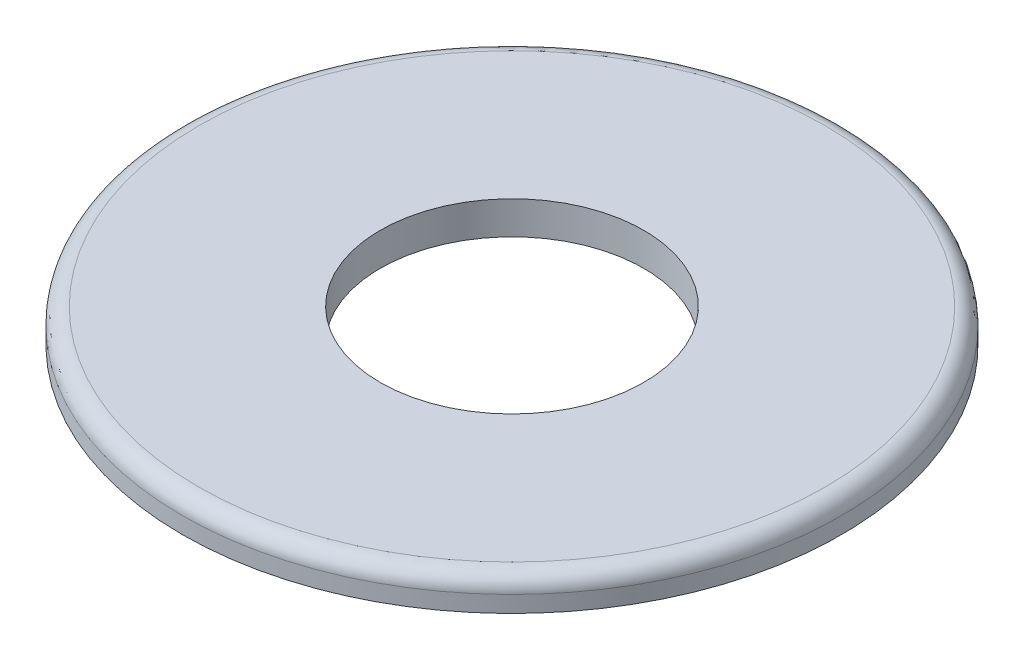
ISO-10303-21;
HEADER;
FILE_DESCRIPTION(('STEP AP214'),'2;1');
FILE_NAME('part.step','',(''),(''),'','','');
FILE_SCHEMA(('AUTOMOTIVE_DESIGN { 1 0 10303 214 1 1 1 1 }'));
ENDSEC;
DATA;
#1=APPLICATION_CONTEXT('core data for automotive mechanical design processes');
#2=APPLICATION_PROTOCOL_DEFINITION('international standard','automotive_design',2000,#1);
#3=PRODUCT_CONTEXT('',#1,'mechanical');
#4=PRODUCT('Part','Part','',(#3));
#5=PRODUCT_RELATED_PRODUCT_CATEGORY('part','',(#4));
#6=PRODUCT_DEFINITION_FORMATION('','',#4);
#7=PRODUCT_DEFINITION_CONTEXT('part definition',#1,'design');
#8=PRODUCT_DEFINITION('design','',#6,#7);
#9=PRODUCT_DEFINITION_SHAPE('','',#8);
#10=(LENGTH_UNIT() NAMED_UNIT(*) SI_UNIT(.MILLI.,.METRE.));
#11=(NAMED_UNIT(*) PLANE_ANGLE_UNIT() SI_UNIT($,.RADIAN.));
#12=(NAMED_UNIT(*) SI_UNIT($,.STERADIAN.) SOLID_ANGLE_UNIT());
#13=UNCERTAINTY_MEASURE_WITH_UNIT(LENGTH_MEASURE(1.E-05),#10,'distance_accuracy_value','');
#14=(GEOMETRIC_REPRESENTATION_CONTEXT(3) GLOBAL_UNCERTAINTY_ASSIGNED_CONTEXT((#13)) GLOBAL_UNIT_ASSIGNED_CONTEXT((#10,
#11,#12)) REPRESENTATION_CONTEXT('',''));
#15=CARTESIAN_POINT('',(0.,0.,0.));
#16=DIRECTION('',(0.,0.,1.));
#17=DIRECTION('',(1.,0.,0.));
#18=AXIS2_PLACEMENT_3D('',#15,#16,#17);
#19=CARTESIAN_POINT('',(0.,1.,0.));
#20=DIRECTION('',(0.,1.,0.));
#21=DIRECTION('',(0.,0.,1.));
#22=AXIS2_PLACEMENT_3D('',#19,#20,#21);
#23=PLANE('',#22);
#24=CARTESIAN_POINT('',(0.,1.,0.));
#25=DIRECTION('',(0.,1.,0.));
#26=DIRECTION('',(0.,0.,1.));
#27=AXIS2_PLACEMENT_3D('',#24,#25,#26);
#28=CIRCLE('',#27,9.5);
#29=CARTESIAN_POINT('',(0.,1.,9.5));
#30=VERTEX_POINT('',#29);
#31=EDGE_CURVE('E37',#30,#30,#28,.T.);
#32=ORIENTED_EDGE('',*,*,#31,.T.);
#33=EDGE_LOOP('',(#32));
#34=FACE_BOUND('',#33,.T.);
#35=CARTESIAN_POINT('',(0.,1.,0.));
#36=DIRECTION('',(0.,1.,0.));
#37=DIRECTION('',(0.,0.,1.));
#38=AXIS2_PLACEMENT_3D('',#35,#36,#37);
#39=CIRCLE('',#38,4.);
#40=CARTESIAN_POINT('',(0.,1.,4.));
#41=VERTEX_POINT('',#40);
#42=EDGE_CURVE('E45',#41,#41,#39,.T.);
#43=ORIENTED_EDGE('',*,*,#42,.F.);
#44=EDGE_LOOP('',(#43));
#45=FACE_BOUND('',#44,.T.);
#46=ADVANCED_FACE('F30',(#34,#45),#23,.T.);
#47=CARTESIAN_POINT('',(0.,0.,0.));
#48=DIRECTION('',(0.,1.,0.));
#49=DIRECTION('',(0.,0.,1.));
#50=AXIS2_PLACEMENT_3D('',#47,#48,#49);
#51=PLANE('',#50);
#52=CARTESIAN_POINT('',(0.,0.,0.));
#53=DIRECTION('',(0.,1.,0.));
#54=DIRECTION('',(0.,0.,1.));
#55=AXIS2_PLACEMENT_3D('',#52,#53,#54);
#56=CIRCLE('',#55,10.);
#57=CARTESIAN_POINT('',(0.,0.,10.));
#58=VERTEX_POINT('',#57);
#59=EDGE_CURVE('E41',#58,#58,#56,.T.);
#60=ORIENTED_EDGE('',*,*,#59,.F.);
#61=EDGE_LOOP('',(#60));
#62=FACE_BOUND('',#61,.T.);
#63=CARTESIAN_POINT('',(0.,0.,0.));
#64=DIRECTION('',(0.,1.,0.));
#65=DIRECTION('',(0.,0.,1.));
#66=AXIS2_PLACEMENT_3D('',#63,#64,#65);
#67=CIRCLE('',#66,4.);
#68=CARTESIAN_POINT('',(0.,0.,4.));
#69=VERTEX_POINT('',#68);
#70=EDGE_CURVE('E48',#69,#69,#67,.T.);
#71=ORIENTED_EDGE('',*,*,#70,.T.);
#72=EDGE_LOOP('',(#71));
#73=FACE_BOUND('',#72,.T.);
#74=ADVANCED_FACE('F58',(#62,#73),#51,.F.);
#75=CARTESIAN_POINT('',(0.,1.,0.));
#76=DIRECTION('',(0.,-1.,0.));
#77=DIRECTION('',(0.,0.,-1.));
#78=AXIS2_PLACEMENT_3D('',#75,#76,#77);
#79=CYLINDRICAL_SURFACE('',#78,10.);
#80=CARTESIAN_POINT('',(0.,0.5,0.));
#81=DIRECTION('',(0.,1.,0.));
#82=DIRECTION('',(0.,0.,1.));
#83=AXIS2_PLACEMENT_3D('',#80,#81,#82);
#84=CIRCLE('',#83,10.);
#85=CARTESIAN_POINT('',(0.,0.5,10.));
#86=VERTEX_POINT('',#85);
#87=EDGE_CURVE('E10',#86,#86,#84,.F.);
#88=ORIENTED_EDGE('',*,*,#87,.T.);
#89=EDGE_LOOP('',(#88));
#90=FACE_BOUND('',#89,.T.);
#91=ORIENTED_EDGE('',*,*,#59,.T.);
#92=EDGE_LOOP('',(#91));
#93=FACE_BOUND('',#92,.T.);
#94=ADVANCED_FACE('F63',(#90,#93),#79,.T.);
#95=CARTESIAN_POINT('',(0.,1.,0.));
#96=DIRECTION('',(0.,-1.,0.));
#97=DIRECTION('',(0.,0.,-1.));
#98=AXIS2_PLACEMENT_3D('',#95,#96,#97);
#99=CYLINDRICAL_SURFACE('',#98,4.);
#100=ORIENTED_EDGE('',*,*,#42,.T.);
#101=EDGE_LOOP('',(#100));
#102=FACE_BOUND('',#101,.T.);
#103=ORIENTED_EDGE('',*,*,#70,.F.);
#104=EDGE_LOOP('',(#103));
#105=FACE_BOUND('',#104,.T.);
#106=ADVANCED_FACE('F54',(#102,#105),#99,.F.);
#107=CARTESIAN_POINT('',(0.,0.5,0.));
#108=DIRECTION('',(0.,1.,0.));
#109=DIRECTION('',(0.,0.,1.));
#110=AXIS2_PLACEMENT_3D('',#107,#108,#109);
#111=TOROIDAL_SURFACE('',#110,9.5,0.5);
#112=ORIENTED_EDGE('',*,*,#87,.F.);
#113=EDGE_LOOP('',(#112));
#114=FACE_BOUND('',#113,.T.);
#115=ORIENTED_EDGE('',*,*,#31,.F.);
#116=EDGE_LOOP('',(#115));
#117=FACE_BOUND('',#116,.T.);
#118=ADVANCED_FACE('F32',(#114,#117),#111,.T.);
#119=CLOSED_SHELL('',(#46,#74,#94,#106,#118));
#120=MANIFOLD_SOLID_BREP('B2',#119);
#121=ADVANCED_BREP_SHAPE_REPRESENTATION('',(#18,#120),#14);
#122=SHAPE_DEFINITION_REPRESENTATION(#9,#121);
ENDSEC;
END-ISO-10303-21;
